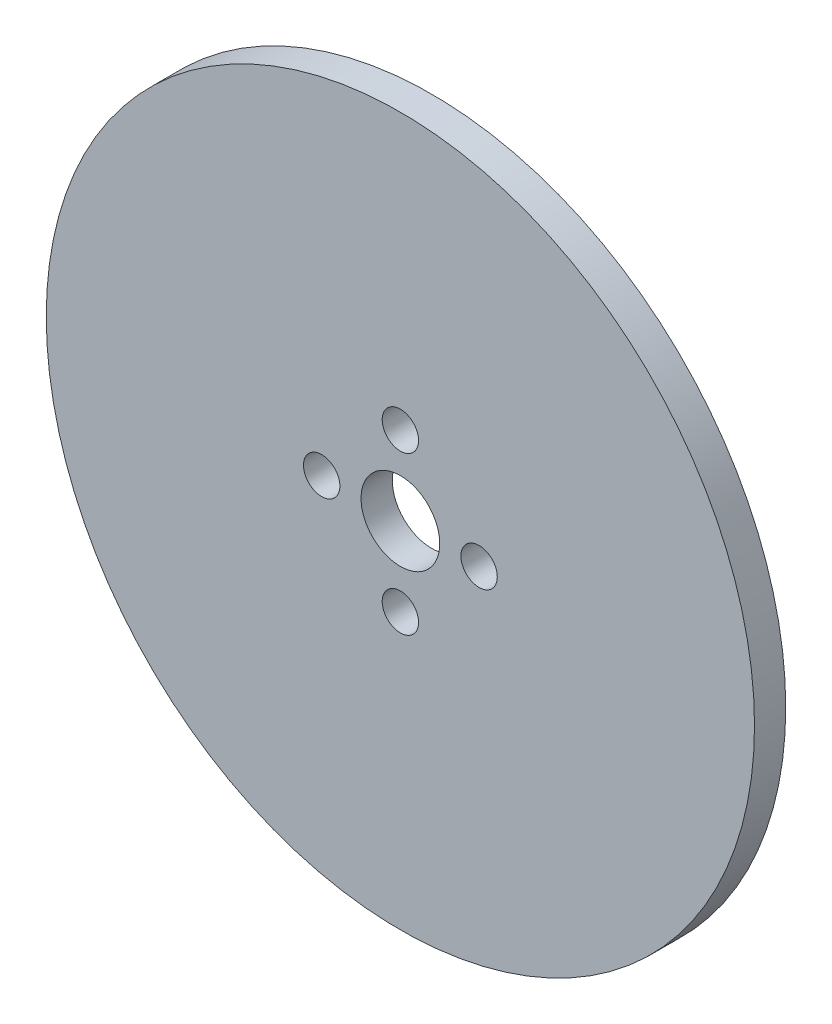
ISO-10303-21;
HEADER;
FILE_DESCRIPTION(('STEP AP214'),'2;1');
FILE_NAME('part.step','',(''),(''),'','','');
FILE_SCHEMA(('AUTOMOTIVE_DESIGN { 1 0 10303 214 1 1 1 1 }'));
ENDSEC;
DATA;
#1=APPLICATION_CONTEXT('core data for automotive mechanical design processes');
#2=APPLICATION_PROTOCOL_DEFINITION('international standard','automotive_design',2000,#1);
#3=PRODUCT_CONTEXT('',#1,'mechanical');
#4=PRODUCT('Part','Part','',(#3));
#5=PRODUCT_RELATED_PRODUCT_CATEGORY('part','',(#4));
#6=PRODUCT_DEFINITION_FORMATION('','',#4);
#7=PRODUCT_DEFINITION_CONTEXT('part definition',#1,'design');
#8=PRODUCT_DEFINITION('design','',#6,#7);
#9=PRODUCT_DEFINITION_SHAPE('','',#8);
#10=(LENGTH_UNIT() NAMED_UNIT(*) SI_UNIT(.MILLI.,.METRE.));
#11=(NAMED_UNIT(*) PLANE_ANGLE_UNIT() SI_UNIT($,.RADIAN.));
#12=(NAMED_UNIT(*) SI_UNIT($,.STERADIAN.) SOLID_ANGLE_UNIT());
#13=UNCERTAINTY_MEASURE_WITH_UNIT(LENGTH_MEASURE(1.E-05),#10,'distance_accuracy_value','');
#14=(GEOMETRIC_REPRESENTATION_CONTEXT(3) GLOBAL_UNCERTAINTY_ASSIGNED_CONTEXT((#13)) GLOBAL_UNIT_ASSIGNED_CONTEXT((#10,
#11,#12)) REPRESENTATION_CONTEXT('',''));
#15=CARTESIAN_POINT('',(0.,0.,0.));
#16=DIRECTION('',(0.,0.,1.));
#17=DIRECTION('',(1.,0.,0.));
#18=AXIS2_PLACEMENT_3D('',#15,#16,#17);
#19=CARTESIAN_POINT('',(0.,0.,3.175));
#20=DIRECTION('',(0.,0.,-1.));
#21=DIRECTION('',(-1.,0.,0.));
#22=AXIS2_PLACEMENT_3D('',#19,#20,#21);
#23=PLANE('',#22);
#24=CARTESIAN_POINT('',(0.,0.,3.175));
#25=DIRECTION('',(0.,0.,1.));
#26=DIRECTION('',(-1.,0.,0.));
#27=AXIS2_PLACEMENT_3D('',#24,#25,#26);
#28=CIRCLE('',#27,36.);
#29=CARTESIAN_POINT('',(-36.,0.,3.175));
#30=VERTEX_POINT('',#29);
#31=EDGE_CURVE('E10',#30,#30,#28,.T.);
#32=ORIENTED_EDGE('',*,*,#31,.T.);
#33=EDGE_LOOP('',(#32));
#34=FACE_BOUND('',#33,.T.);
#35=CARTESIAN_POINT('',(0.,0.,3.175));
#36=DIRECTION('',(0.,0.,1.));
#37=DIRECTION('',(1.,0.,0.));
#38=AXIS2_PLACEMENT_3D('',#35,#36,#37);
#39=CIRCLE('',#38,4.);
#40=CARTESIAN_POINT('',(4.00000000000001,0.,3.175));
#41=VERTEX_POINT('',#40);
#42=EDGE_CURVE('E42',#41,#41,#39,.T.);
#43=ORIENTED_EDGE('',*,*,#42,.F.);
#44=EDGE_LOOP('',(#43));
#45=FACE_BOUND('',#44,.T.);
#46=CARTESIAN_POINT('',(-8.,0.,3.175));
#47=DIRECTION('',(0.,0.,1.));
#48=DIRECTION('',(1.,0.,0.));
#49=AXIS2_PLACEMENT_3D('',#46,#47,#48);
#50=CIRCLE('',#49,1.85);
#51=CARTESIAN_POINT('',(-6.15,0.,3.175));
#52=VERTEX_POINT('',#51);
#53=EDGE_CURVE('E47',#52,#52,#50,.T.);
#54=ORIENTED_EDGE('',*,*,#53,.F.);
#55=EDGE_LOOP('',(#54));
#56=FACE_BOUND('',#55,.T.);
#57=CARTESIAN_POINT('',(0.,-8.,3.175));
#58=DIRECTION('',(0.,0.,1.));
#59=DIRECTION('',(1.,0.,0.));
#60=AXIS2_PLACEMENT_3D('',#57,#58,#59);
#61=CIRCLE('',#60,1.85);
#62=CARTESIAN_POINT('',(1.85,-8.,3.175));
#63=VERTEX_POINT('',#62);
#64=EDGE_CURVE('E53',#63,#63,#61,.T.);
#65=ORIENTED_EDGE('',*,*,#64,.F.);
#66=EDGE_LOOP('',(#65));
#67=FACE_BOUND('',#66,.T.);
#68=CARTESIAN_POINT('',(0.,8.,3.175));
#69=DIRECTION('',(0.,0.,1.));
#70=DIRECTION('',(1.,0.,0.));
#71=AXIS2_PLACEMENT_3D('',#68,#69,#70);
#72=CIRCLE('',#71,1.85);
#73=CARTESIAN_POINT('',(1.85,8.,3.175));
#74=VERTEX_POINT('',#73);
#75=EDGE_CURVE('E59',#74,#74,#72,.T.);
#76=ORIENTED_EDGE('',*,*,#75,.F.);
#77=EDGE_LOOP('',(#76));
#78=FACE_BOUND('',#77,.T.);
#79=CARTESIAN_POINT('',(8.,0.,3.175));
#80=DIRECTION('',(0.,0.,1.));
#81=DIRECTION('',(1.,0.,0.));
#82=AXIS2_PLACEMENT_3D('',#79,#80,#81);
#83=CIRCLE('',#82,1.85);
#84=CARTESIAN_POINT('',(9.85,0.,3.175));
#85=VERTEX_POINT('',#84);
#86=EDGE_CURVE('E65',#85,#85,#83,.T.);
#87=ORIENTED_EDGE('',*,*,#86,.F.);
#88=EDGE_LOOP('',(#87));
#89=FACE_BOUND('',#88,.T.);
#90=ADVANCED_FACE('F31',(#34,#45,#56,#67,#78,#89),#23,.F.);
#91=CARTESIAN_POINT('',(0.,0.,0.));
#92=DIRECTION('',(0.,0.,-1.));
#93=DIRECTION('',(-1.,0.,0.));
#94=AXIS2_PLACEMENT_3D('',#91,#92,#93);
#95=PLANE('',#94);
#96=CARTESIAN_POINT('',(0.,8.,0.));
#97=DIRECTION('',(0.,0.,1.));
#98=DIRECTION('',(1.,0.,0.));
#99=AXIS2_PLACEMENT_3D('',#96,#97,#98);
#100=CIRCLE('',#99,1.85);
#101=CARTESIAN_POINT('',(1.85,8.,0.));
#102=VERTEX_POINT('',#101);
#103=EDGE_CURVE('E62',#102,#102,#100,.T.);
#104=ORIENTED_EDGE('',*,*,#103,.T.);
#105=EDGE_LOOP('',(#104));
#106=FACE_BOUND('',#105,.T.);
#107=CARTESIAN_POINT('',(-8.,0.,0.));
#108=DIRECTION('',(0.,0.,1.));
#109=DIRECTION('',(1.,0.,0.));
#110=AXIS2_PLACEMENT_3D('',#107,#108,#109);
#111=CIRCLE('',#110,1.85);
#112=CARTESIAN_POINT('',(-6.15,0.,0.));
#113=VERTEX_POINT('',#112);
#114=EDGE_CURVE('E50',#113,#113,#111,.T.);
#115=ORIENTED_EDGE('',*,*,#114,.T.);
#116=EDGE_LOOP('',(#115));
#117=FACE_BOUND('',#116,.T.);
#118=CARTESIAN_POINT('',(0.,0.,0.));
#119=DIRECTION('',(0.,0.,1.));
#120=DIRECTION('',(1.,0.,0.));
#121=AXIS2_PLACEMENT_3D('',#118,#119,#120);
#122=CIRCLE('',#121,36.);
#123=CARTESIAN_POINT('',(36.,0.,0.));
#124=VERTEX_POINT('',#123);
#125=EDGE_CURVE('E35',#124,#124,#122,.T.);
#126=ORIENTED_EDGE('',*,*,#125,.F.);
#127=EDGE_LOOP('',(#126));
#128=FACE_BOUND('',#127,.T.);
#129=CARTESIAN_POINT('',(0.,0.,0.));
#130=DIRECTION('',(0.,0.,1.));
#131=DIRECTION('',(1.,0.,0.));
#132=AXIS2_PLACEMENT_3D('',#129,#130,#131);
#133=CIRCLE('',#132,4.);
#134=CARTESIAN_POINT('',(4.00000000000001,0.,0.));
#135=VERTEX_POINT('',#134);
#136=EDGE_CURVE('E44',#135,#135,#133,.T.);
#137=ORIENTED_EDGE('',*,*,#136,.T.);
#138=EDGE_LOOP('',(#137));
#139=FACE_BOUND('',#138,.T.);
#140=CARTESIAN_POINT('',(0.,-8.,0.));
#141=DIRECTION('',(0.,0.,1.));
#142=DIRECTION('',(1.,0.,0.));
#143=AXIS2_PLACEMENT_3D('',#140,#141,#142);
#144=CIRCLE('',#143,1.85);
#145=CARTESIAN_POINT('',(1.85,-8.,0.));
#146=VERTEX_POINT('',#145);
#147=EDGE_CURVE('E56',#146,#146,#144,.T.);
#148=ORIENTED_EDGE('',*,*,#147,.T.);
#149=EDGE_LOOP('',(#148));
#150=FACE_BOUND('',#149,.T.);
#151=CARTESIAN_POINT('',(8.,0.,0.));
#152=DIRECTION('',(0.,0.,1.));
#153=DIRECTION('',(1.,0.,0.));
#154=AXIS2_PLACEMENT_3D('',#151,#152,#153);
#155=CIRCLE('',#154,1.85);
#156=CARTESIAN_POINT('',(9.85,0.,0.));
#157=VERTEX_POINT('',#156);
#158=EDGE_CURVE('E68',#157,#157,#155,.T.);
#159=ORIENTED_EDGE('',*,*,#158,.T.);
#160=EDGE_LOOP('',(#159));
#161=FACE_BOUND('',#160,.T.);
#162=ADVANCED_FACE('F78',(#106,#117,#128,#139,#150,#161),#95,.T.);
#163=CARTESIAN_POINT('',(0.,0.,3.175));
#164=DIRECTION('',(0.,0.,-1.));
#165=DIRECTION('',(-1.,0.,0.));
#166=AXIS2_PLACEMENT_3D('',#163,#164,#165);
#167=CYLINDRICAL_SURFACE('',#166,36.);
#168=ORIENTED_EDGE('',*,*,#125,.T.);
#169=EDGE_LOOP('',(#168));
#170=FACE_BOUND('',#169,.T.);
#171=ORIENTED_EDGE('',*,*,#31,.F.);
#172=EDGE_LOOP('',(#171));
#173=FACE_BOUND('',#172,.T.);
#174=ADVANCED_FACE('F33',(#170,#173),#167,.T.);
#175=CARTESIAN_POINT('',(0.,0.,3.175));
#176=DIRECTION('',(0.,0.,-1.));
#177=DIRECTION('',(-1.,0.,0.));
#178=AXIS2_PLACEMENT_3D('',#175,#176,#177);
#179=CYLINDRICAL_SURFACE('',#178,4.);
#180=ORIENTED_EDGE('',*,*,#42,.T.);
#181=EDGE_LOOP('',(#180));
#182=FACE_BOUND('',#181,.T.);
#183=ORIENTED_EDGE('',*,*,#136,.F.);
#184=EDGE_LOOP('',(#183));
#185=FACE_BOUND('',#184,.T.);
#186=ADVANCED_FACE('F86',(#182,#185),#179,.F.);
#187=CARTESIAN_POINT('',(-8.,0.,3.175));
#188=DIRECTION('',(0.,0.,-1.));
#189=DIRECTION('',(-1.,0.,0.));
#190=AXIS2_PLACEMENT_3D('',#187,#188,#189);
#191=CYLINDRICAL_SURFACE('',#190,1.85);
#192=ORIENTED_EDGE('',*,*,#53,.T.);
#193=EDGE_LOOP('',(#192));
#194=FACE_BOUND('',#193,.T.);
#195=ORIENTED_EDGE('',*,*,#114,.F.);
#196=EDGE_LOOP('',(#195));
#197=FACE_BOUND('',#196,.T.);
#198=ADVANCED_FACE('F89',(#194,#197),#191,.F.);
#199=CARTESIAN_POINT('',(0.,-8.,3.175));
#200=DIRECTION('',(0.,0.,-1.));
#201=DIRECTION('',(-1.,0.,0.));
#202=AXIS2_PLACEMENT_3D('',#199,#200,#201);
#203=CYLINDRICAL_SURFACE('',#202,1.85);
#204=ORIENTED_EDGE('',*,*,#64,.T.);
#205=EDGE_LOOP('',(#204));
#206=FACE_BOUND('',#205,.T.);
#207=ORIENTED_EDGE('',*,*,#147,.F.);
#208=EDGE_LOOP('',(#207));
#209=FACE_BOUND('',#208,.T.);
#210=ADVANCED_FACE('F93',(#206,#209),#203,.F.);
#211=CARTESIAN_POINT('',(0.,8.,3.175));
#212=DIRECTION('',(0.,0.,-1.));
#213=DIRECTION('',(-1.,0.,0.));
#214=AXIS2_PLACEMENT_3D('',#211,#212,#213);
#215=CYLINDRICAL_SURFACE('',#214,1.85);
#216=ORIENTED_EDGE('',*,*,#75,.T.);
#217=EDGE_LOOP('',(#216));
#218=FACE_BOUND('',#217,.T.);
#219=ORIENTED_EDGE('',*,*,#103,.F.);
#220=EDGE_LOOP('',(#219));
#221=FACE_BOUND('',#220,.T.);
#222=ADVANCED_FACE('F97',(#218,#221),#215,.F.);
#223=CARTESIAN_POINT('',(8.,0.,3.175));
#224=DIRECTION('',(0.,0.,-1.));
#225=DIRECTION('',(-1.,0.,0.));
#226=AXIS2_PLACEMENT_3D('',#223,#224,#225);
#227=CYLINDRICAL_SURFACE('',#226,1.85);
#228=ORIENTED_EDGE('',*,*,#86,.T.);
#229=EDGE_LOOP('',(#228));
#230=FACE_BOUND('',#229,.T.);
#231=ORIENTED_EDGE('',*,*,#158,.F.);
#232=EDGE_LOOP('',(#231));
#233=FACE_BOUND('',#232,.T.);
#234=ADVANCED_FACE('F74',(#230,#233),#227,.F.);
#235=CLOSED_SHELL('',(#90,#162,#174,#186,#198,#210,#222,#234));
#236=MANIFOLD_SOLID_BREP('B2',#235);
#237=ADVANCED_BREP_SHAPE_REPRESENTATION('',(#18,#236),#14);
#238=SHAPE_DEFINITION_REPRESENTATION(#9,#237);
ENDSEC;
END-ISO-10303-21;
